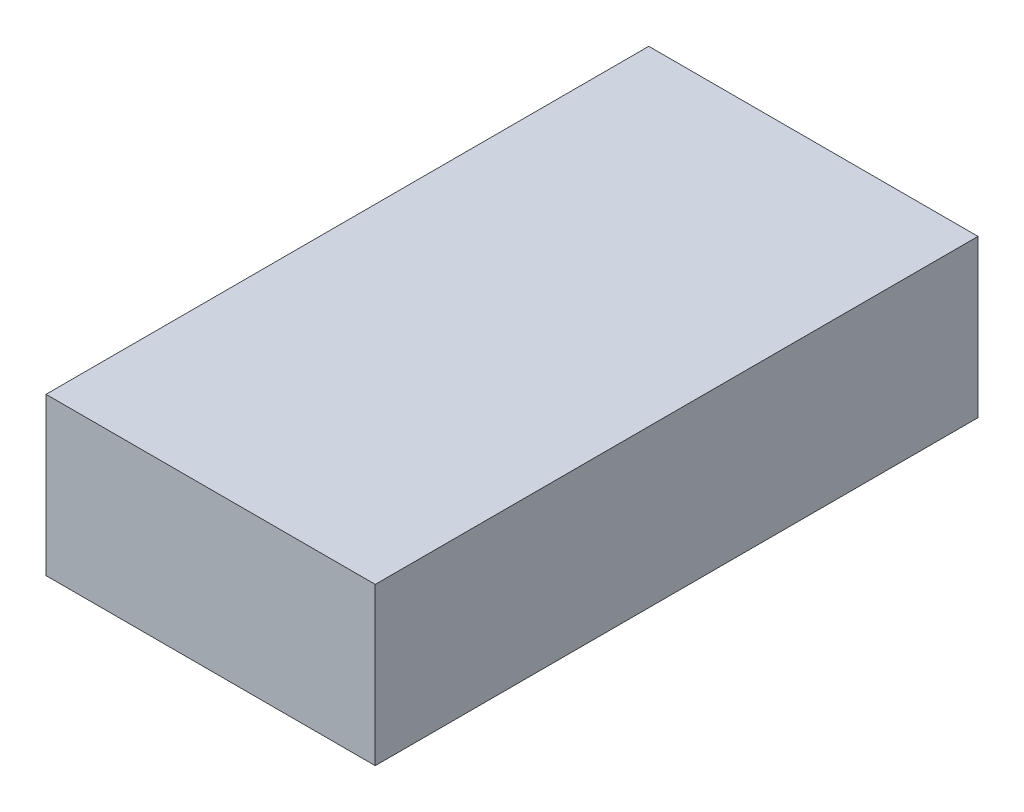
ISO-10303-21;
HEADER;
FILE_DESCRIPTION(('STEP AP214'),'2;1');
FILE_NAME('part.step','',(''),(''),'','','');
FILE_SCHEMA(('AUTOMOTIVE_DESIGN { 1 0 10303 214 1 1 1 1 }'));
ENDSEC;
DATA;
#1=APPLICATION_CONTEXT('core data for automotive mechanical design processes');
#2=APPLICATION_PROTOCOL_DEFINITION('international standard','automotive_design',2000,#1);
#3=PRODUCT_CONTEXT('',#1,'mechanical');
#4=PRODUCT('Part','Part','',(#3));
#5=PRODUCT_RELATED_PRODUCT_CATEGORY('part','',(#4));
#6=PRODUCT_DEFINITION_FORMATION('','',#4);
#7=PRODUCT_DEFINITION_CONTEXT('part definition',#1,'design');
#8=PRODUCT_DEFINITION('design','',#6,#7);
#9=PRODUCT_DEFINITION_SHAPE('','',#8);
#10=(LENGTH_UNIT() NAMED_UNIT(*) SI_UNIT(.MILLI.,.METRE.));
#11=(NAMED_UNIT(*) PLANE_ANGLE_UNIT() SI_UNIT($,.RADIAN.));
#12=(NAMED_UNIT(*) SI_UNIT($,.STERADIAN.) SOLID_ANGLE_UNIT());
#13=UNCERTAINTY_MEASURE_WITH_UNIT(LENGTH_MEASURE(1.E-05),#10,'distance_accuracy_value','');
#14=(GEOMETRIC_REPRESENTATION_CONTEXT(3) GLOBAL_UNCERTAINTY_ASSIGNED_CONTEXT((#13)) GLOBAL_UNIT_ASSIGNED_CONTEXT((#10,
#11,#12)) REPRESENTATION_CONTEXT('',''));
#15=CARTESIAN_POINT('',(0.,0.,0.));
#16=DIRECTION('',(0.,0.,1.));
#17=DIRECTION('',(1.,0.,0.));
#18=AXIS2_PLACEMENT_3D('',#15,#16,#17);
#19=CARTESIAN_POINT('',(16.25,15.5,29.75));
#20=DIRECTION('',(-1.,0.,0.));
#21=DIRECTION('',(0.,0.,1.));
#22=AXIS2_PLACEMENT_3D('',#19,#20,#21);
#23=PLANE('',#22);
#24=DIRECTION('',(0.,0.,-1.));
#25=VECTOR('',#24,1.);
#26=CARTESIAN_POINT('',(16.25,0.,29.75));
#27=LINE('',#26,#25);
#28=CARTESIAN_POINT('',(16.25,0.,29.75));
#29=VERTEX_POINT('',#28);
#30=CARTESIAN_POINT('',(16.25,0.,-29.75));
#31=VERTEX_POINT('',#30);
#32=EDGE_CURVE('E107',#29,#31,#27,.T.);
#33=ORIENTED_EDGE('',*,*,#32,.T.);
#34=DIRECTION('',(0.,-1.,0.));
#35=VECTOR('',#34,1.);
#36=CARTESIAN_POINT('',(16.25,15.5,-29.75));
#37=LINE('',#36,#35);
#38=CARTESIAN_POINT('',(16.25,15.5,-29.75));
#39=VERTEX_POINT('',#38);
#40=EDGE_CURVE('E11',#39,#31,#37,.T.);
#41=ORIENTED_EDGE('',*,*,#40,.F.);
#42=DIRECTION('',(0.,0.,-1.));
#43=VECTOR('',#42,1.);
#44=CARTESIAN_POINT('',(16.25,15.5,29.75));
#45=LINE('',#44,#43);
#46=CARTESIAN_POINT('',(16.25,15.5,29.75));
#47=VERTEX_POINT('',#46);
#48=EDGE_CURVE('E91',#47,#39,#45,.T.);
#49=ORIENTED_EDGE('',*,*,#48,.F.);
#50=DIRECTION('',(0.,-1.,0.));
#51=VECTOR('',#50,1.);
#52=CARTESIAN_POINT('',(16.25,15.5,29.75));
#53=LINE('',#52,#51);
#54=EDGE_CURVE('E103',#47,#29,#53,.T.);
#55=ORIENTED_EDGE('',*,*,#54,.T.);
#56=EDGE_LOOP('',(#33,#41,#49,#55));
#57=FACE_BOUND('',#56,.T.);
#58=ADVANCED_FACE('F39',(#57),#23,.F.);
#59=CARTESIAN_POINT('',(-16.25,15.5,-29.75));
#60=DIRECTION('',(0.,0.,1.));
#61=DIRECTION('',(1.,0.,0.));
#62=AXIS2_PLACEMENT_3D('',#59,#60,#61);
#63=PLANE('',#62);
#64=DIRECTION('',(-1.,0.,0.));
#65=VECTOR('',#64,1.);
#66=CARTESIAN_POINT('',(-16.25,0.,-29.75));
#67=LINE('',#66,#65);
#68=CARTESIAN_POINT('',(-16.25,0.,-29.75));
#69=VERTEX_POINT('',#68);
#70=EDGE_CURVE('E96',#31,#69,#67,.T.);
#71=ORIENTED_EDGE('',*,*,#70,.T.);
#72=DIRECTION('',(0.,-1.,0.));
#73=VECTOR('',#72,1.);
#74=CARTESIAN_POINT('',(-16.25,15.5,-29.75));
#75=LINE('',#74,#73);
#76=CARTESIAN_POINT('',(-16.25,15.5,-29.75));
#77=VERTEX_POINT('',#76);
#78=EDGE_CURVE('E48',#77,#69,#75,.T.);
#79=ORIENTED_EDGE('',*,*,#78,.F.);
#80=DIRECTION('',(-1.,0.,0.));
#81=VECTOR('',#80,1.);
#82=CARTESIAN_POINT('',(-16.25,15.5,-29.75));
#83=LINE('',#82,#81);
#84=EDGE_CURVE('E86',#39,#77,#83,.T.);
#85=ORIENTED_EDGE('',*,*,#84,.F.);
#86=ORIENTED_EDGE('',*,*,#40,.T.);
#87=EDGE_LOOP('',(#71,#79,#85,#86));
#88=FACE_BOUND('',#87,.T.);
#89=ADVANCED_FACE('F95',(#88),#63,.F.);
#90=CARTESIAN_POINT('',(-16.25,15.5,29.75));
#91=DIRECTION('',(1.,0.,0.));
#92=DIRECTION('',(0.,0.,-1.));
#93=AXIS2_PLACEMENT_3D('',#90,#91,#92);
#94=PLANE('',#93);
#95=DIRECTION('',(0.,0.,1.));
#96=VECTOR('',#95,1.);
#97=CARTESIAN_POINT('',(-16.25,0.,29.75));
#98=LINE('',#97,#96);
#99=CARTESIAN_POINT('',(-16.25,0.,29.75));
#100=VERTEX_POINT('',#99);
#101=EDGE_CURVE('E73',#69,#100,#98,.T.);
#102=ORIENTED_EDGE('',*,*,#101,.T.);
#103=DIRECTION('',(0.,-1.,0.));
#104=VECTOR('',#103,1.);
#105=CARTESIAN_POINT('',(-16.25,15.5,29.75));
#106=LINE('',#105,#104);
#107=CARTESIAN_POINT('',(-16.25,15.5,29.75));
#108=VERTEX_POINT('',#107);
#109=EDGE_CURVE('E98',#108,#100,#106,.T.);
#110=ORIENTED_EDGE('',*,*,#109,.F.);
#111=DIRECTION('',(0.,0.,1.));
#112=VECTOR('',#111,1.);
#113=CARTESIAN_POINT('',(-16.25,15.5,29.75));
#114=LINE('',#113,#112);
#115=EDGE_CURVE('E89',#77,#108,#114,.T.);
#116=ORIENTED_EDGE('',*,*,#115,.F.);
#117=ORIENTED_EDGE('',*,*,#78,.T.);
#118=EDGE_LOOP('',(#102,#110,#116,#117));
#119=FACE_BOUND('',#118,.T.);
#120=ADVANCED_FACE('F99',(#119),#94,.F.);
#121=CARTESIAN_POINT('',(-16.25,15.5,29.75));
#122=DIRECTION('',(0.,0.,-1.));
#123=DIRECTION('',(-1.,0.,0.));
#124=AXIS2_PLACEMENT_3D('',#121,#122,#123);
#125=PLANE('',#124);
#126=DIRECTION('',(1.,0.,0.));
#127=VECTOR('',#126,1.);
#128=CARTESIAN_POINT('',(-16.25,0.,29.75));
#129=LINE('',#128,#127);
#130=EDGE_CURVE('E79',#100,#29,#129,.T.);
#131=ORIENTED_EDGE('',*,*,#130,.T.);
#132=ORIENTED_EDGE('',*,*,#54,.F.);
#133=DIRECTION('',(1.,0.,0.));
#134=VECTOR('',#133,1.);
#135=CARTESIAN_POINT('',(-16.25,15.5,29.75));
#136=LINE('',#135,#134);
#137=EDGE_CURVE('E56',#108,#47,#136,.T.);
#138=ORIENTED_EDGE('',*,*,#137,.F.);
#139=ORIENTED_EDGE('',*,*,#109,.T.);
#140=EDGE_LOOP('',(#131,#132,#138,#139));
#141=FACE_BOUND('',#140,.T.);
#142=ADVANCED_FACE('F120',(#141),#125,.F.);
#143=CARTESIAN_POINT('',(0.,15.5,0.));
#144=DIRECTION('',(0.,-1.,0.));
#145=DIRECTION('',(0.,0.,-1.));
#146=AXIS2_PLACEMENT_3D('',#143,#144,#145);
#147=PLANE('',#146);
#148=ORIENTED_EDGE('',*,*,#48,.T.);
#149=ORIENTED_EDGE('',*,*,#84,.T.);
#150=ORIENTED_EDGE('',*,*,#115,.T.);
#151=ORIENTED_EDGE('',*,*,#137,.T.);
#152=EDGE_LOOP('',(#148,#149,#150,#151));
#153=FACE_BOUND('',#152,.T.);
#154=ADVANCED_FACE('F87',(#153),#147,.F.);
#155=CARTESIAN_POINT('',(0.,0.,0.));
#156=DIRECTION('',(0.,-1.,0.));
#157=DIRECTION('',(0.,0.,-1.));
#158=AXIS2_PLACEMENT_3D('',#155,#156,#157);
#159=PLANE('',#158);
#160=ORIENTED_EDGE('',*,*,#32,.F.);
#161=ORIENTED_EDGE('',*,*,#130,.F.);
#162=ORIENTED_EDGE('',*,*,#101,.F.);
#163=ORIENTED_EDGE('',*,*,#70,.F.);
#164=EDGE_LOOP('',(#160,#161,#162,#163));
#165=FACE_BOUND('',#164,.T.);
#166=ADVANCED_FACE('F123',(#165),#159,.T.);
#167=CLOSED_SHELL('',(#58,#89,#120,#142,#154,#166));
#168=MANIFOLD_SOLID_BREP('B2',#167);
#169=ADVANCED_BREP_SHAPE_REPRESENTATION('',(#18,#168),#14);
#170=SHAPE_DEFINITION_REPRESENTATION(#9,#169);
ENDSEC;
END-ISO-10303-21;
